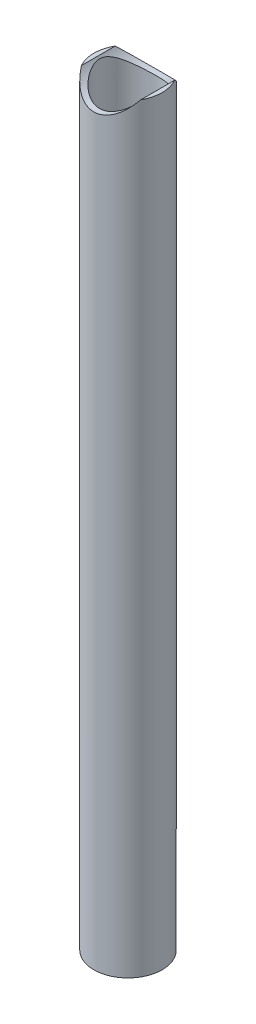
ISO-10303-21;
HEADER;
FILE_DESCRIPTION(('STEP AP214'),'2;1');
FILE_NAME('part.step','',(''),(''),'','','');
FILE_SCHEMA(('AUTOMOTIVE_DESIGN { 1 0 10303 214 1 1 1 1 }'));
ENDSEC;
DATA;
#1=APPLICATION_CONTEXT('core data for automotive mechanical design processes');
#2=APPLICATION_PROTOCOL_DEFINITION('international standard','automotive_design',2000,#1);
#3=PRODUCT_CONTEXT('',#1,'mechanical');
#4=PRODUCT('Part','Part','',(#3));
#5=PRODUCT_RELATED_PRODUCT_CATEGORY('part','',(#4));
#6=PRODUCT_DEFINITION_FORMATION('','',#4);
#7=PRODUCT_DEFINITION_CONTEXT('part definition',#1,'design');
#8=PRODUCT_DEFINITION('design','',#6,#7);
#9=PRODUCT_DEFINITION_SHAPE('','',#8);
#10=(LENGTH_UNIT() NAMED_UNIT(*) SI_UNIT(.MILLI.,.METRE.));
#11=(NAMED_UNIT(*) PLANE_ANGLE_UNIT() SI_UNIT($,.RADIAN.));
#12=(NAMED_UNIT(*) SI_UNIT($,.STERADIAN.) SOLID_ANGLE_UNIT());
#13=UNCERTAINTY_MEASURE_WITH_UNIT(LENGTH_MEASURE(1.E-05),#10,'distance_accuracy_value','');
#14=(GEOMETRIC_REPRESENTATION_CONTEXT(3) GLOBAL_UNCERTAINTY_ASSIGNED_CONTEXT((#13)) GLOBAL_UNIT_ASSIGNED_CONTEXT((#10,
#11,#12)) REPRESENTATION_CONTEXT('',''));
#15=CARTESIAN_POINT('',(0.,0.,0.));
#16=DIRECTION('',(0.,0.,1.));
#17=DIRECTION('',(1.,0.,0.));
#18=AXIS2_PLACEMENT_3D('',#15,#16,#17);
#19=CARTESIAN_POINT('',(0.,0.,0.));
#20=DIRECTION('',(0.,1.,0.));
#21=DIRECTION('',(0.,0.,1.));
#22=AXIS2_PLACEMENT_3D('',#19,#20,#21);
#23=CYLINDRICAL_SURFACE('',#22,17.526);
#24=CARTESIAN_POINT('',(17.5260000000057,467.884334709337,0.));
#25=CARTESIAN_POINT('',(17.5259966167378,467.88432617058,-0.319076188077624));
#26=CARTESIAN_POINT('',(17.51726257199,467.871890608762,-0.638240508763436));
#27=CARTESIAN_POINT('',(17.4825449115086,467.822784525985,-1.27387357273026));
#28=CARTESIAN_POINT('',(17.4565505154207,467.786098859123,-1.59034050610202));
#29=CARTESIAN_POINT('',(17.3878622453003,467.690215161303,-2.21880690947676));
#30=CARTESIAN_POINT('',(17.3451257780519,467.63095972172,-2.53079286403182));
#31=CARTESIAN_POINT('',(17.2438450795274,467.492571776205,-3.14774559895822));
#32=CARTESIAN_POINT('',(17.1852949843206,467.413431897585,-3.45270972991493));
#33=CARTESIAN_POINT('',(17.0290281907694,467.205942571117,-4.16540577796842));
#34=CARTESIAN_POINT('',(16.924830124194,467.070207980364,-4.56956911668166));
#35=CARTESIAN_POINT('',(16.6909426156402,466.774553737813,-5.36131842118699));
#36=CARTESIAN_POINT('',(16.5612408889475,466.614622439433,-5.7488962880344));
#37=CARTESIAN_POINT('',(16.2778377765882,466.27675589372,-6.50824927608016));
#38=CARTESIAN_POINT('',(16.1240772300419,466.098776656443,-6.8799824890451));
#39=CARTESIAN_POINT('',(15.7941184848056,465.730635525697,-7.60695943519018));
#40=CARTESIAN_POINT('',(15.6179210686258,465.540474057212,-7.96220374284949));
#41=CARTESIAN_POINT('',(15.1684387105771,465.074120916929,-8.79691850022176));
#42=CARTESIAN_POINT('',(14.8846663476882,464.794177119885,-9.26867500052876));
#43=CARTESIAN_POINT('',(14.2757977852007,464.228975234517,-10.1815187143384));
#44=CARTESIAN_POINT('',(13.9506852846529,463.943715087962,-10.6225937230168));
#45=CARTESIAN_POINT('',(13.2599882765244,463.376219321179,-11.4731513123116));
#46=CARTESIAN_POINT('',(12.8944394913868,463.093981269169,-11.8826612440536));
#47=CARTESIAN_POINT('',(12.1229083848525,462.539406738952,-12.6688154804112));
#48=CARTESIAN_POINT('',(11.7169405718745,462.267066755405,-13.0454714875213));
#49=CARTESIAN_POINT('',(10.9523102536056,461.793111751858,-13.6895404997737));
#50=CARTESIAN_POINT('',(10.6010399418016,461.588453168338,-13.9635083458199));
#51=CARTESIAN_POINT('',(9.87345155992662,461.19285074123,-14.4871138222371));
#52=CARTESIAN_POINT('',(9.49713454197172,461.001906322262,-14.7367524735));
#53=CARTESIAN_POINT('',(8.72070202883775,460.637341948865,-15.2090842162129));
#54=CARTESIAN_POINT('',(8.32061782316001,460.463699988611,-15.4318116129725));
#55=CARTESIAN_POINT('',(7.49751933777661,460.136876899184,-15.8480419800032));
#56=CARTESIAN_POINT('',(7.07450906657809,459.983692209281,-16.0415500368711));
#57=CARTESIAN_POINT('',(6.28025424486751,459.724825268381,-16.3667690599142));
#58=CARTESIAN_POINT('',(5.91221216564464,459.615484365574,-16.503401754469));
#59=CARTESIAN_POINT('',(5.16329368160522,459.415167450773,-16.7528138187347));
#60=CARTESIAN_POINT('',(4.7824196520745,459.324188061491,-16.8655975752347));
#61=CARTESIAN_POINT('',(4.00999437526974,459.162300485671,-17.0657472209478));
#62=CARTESIAN_POINT('',(3.61844688444468,459.091385335152,-17.1531219295349));
#63=CARTESIAN_POINT('',(2.82705689110886,458.971011274658,-17.3011693137797));
#64=CARTESIAN_POINT('',(2.42721429150704,458.921552615972,-17.3618416767118));
#65=CARTESIAN_POINT('',(1.62057958091167,458.845005592612,-17.4556549470083));
#66=CARTESIAN_POINT('',(1.2137664729376,458.818005078865,-17.4886877379134));
#67=CARTESIAN_POINT('',(0.397941374213328,458.787307210659,-17.5262391050122));
#68=CARTESIAN_POINT('',(-0.0110706209749511,458.783609903252,-17.530757623633));
#69=CARTESIAN_POINT('',(-0.827943717159224,458.799602549319,-17.5111994984361));
#70=CARTESIAN_POINT('',(-1.23580482424931,458.819292378721,-17.4871230063182));
#71=CARTESIAN_POINT('',(-2.04709283680859,458.881613358313,-17.4108036791932));
#72=CARTESIAN_POINT('',(-2.45051986964381,458.924243847782,-17.3585616553922));
#73=CARTESIAN_POINT('',(-3.22539887652972,459.028218129667,-17.2308479950609));
#74=CARTESIAN_POINT('',(-3.59729605361219,459.088256092851,-17.1569948006647));
#75=CARTESIAN_POINT('',(-4.33226890799549,459.226614528515,-16.9863018111114));
#76=CARTESIAN_POINT('',(-4.69534502405514,459.304934089606,-16.8894631618398));
#77=CARTESIAN_POINT('',(-5.41085673321429,459.478531384207,-16.6740198227789));
#78=CARTESIAN_POINT('',(-5.76329076440113,459.573811592977,-16.5554119558831));
#79=CARTESIAN_POINT('',(-6.45595687093966,459.779824257219,-16.2977871460212));
#80=CARTESIAN_POINT('',(-6.79618822322116,459.890557626474,-16.1587689961211));
#81=CARTESIAN_POINT('',(-7.49362304526296,460.136594261049,-15.8481849599276));
#82=CARTESIAN_POINT('',(-7.84955408561314,460.27321634847,-15.6748085298315));
#83=CARTESIAN_POINT('',(-8.54437048022812,460.560835019082,-15.3071530177086));
#84=CARTESIAN_POINT('',(-8.88325498620354,460.71183231655,-15.1128728969553));
#85=CARTESIAN_POINT('',(-9.54331346645607,461.026113663825,-14.7049787879664));
#86=CARTESIAN_POINT('',(-9.86448321905139,461.189400620701,-14.491360222863));
#87=CARTESIAN_POINT('',(-10.4886015638354,461.5261449485,-14.0462403039745));
#88=CARTESIAN_POINT('',(-10.7915476234653,461.699603726425,-13.8147364748272));
#89=CARTESIAN_POINT('',(-11.439848439002,462.091423252358,-13.2853358563753));
#90=CARTESIAN_POINT('',(-11.7809741839097,462.311637517782,-12.9836249082526));
#91=CARTESIAN_POINT('',(-12.4360687716025,462.760219030517,-12.3575971323187));
#92=CARTESIAN_POINT('',(-12.7500333861304,462.988587539436,-12.033276798975));
#93=CARTESIAN_POINT('',(-13.3510865510101,463.450008883021,-11.3627536857685));
#94=CARTESIAN_POINT('',(-13.6381378650007,463.683067681245,-11.0165216667337));
#95=CARTESIAN_POINT('',(-14.1847154460037,464.149482695955,-10.3032235858581));
#96=CARTESIAN_POINT('',(-14.4442441845379,464.382838883827,-9.93615939929388));
#97=CARTESIAN_POINT('',(-14.9253779852041,464.835766313745,-9.19675303324431));
#98=CARTESIAN_POINT('',(-15.1481021343213,465.055510310931,-8.82524531613509));
#99=CARTESIAN_POINT('',(-15.5673632453814,465.486269379661,-8.06270572980613));
#100=CARTESIAN_POINT('',(-15.763895326286,465.697282819178,-7.67167024009006));
#101=CARTESIAN_POINT('',(-16.1293414191598,466.104306922036,-6.87013687577863));
#102=CARTESIAN_POINT('',(-16.2982946475782,466.300338674101,-6.45966772673671));
#103=CARTESIAN_POINT('',(-16.6070872445574,466.670276739207,-5.61835143092385));
#104=CARTESIAN_POINT('',(-16.7469436463786,466.844195973576,-5.18751638865614));
#105=CARTESIAN_POINT('',(-16.9536602371012,467.108069924402,-4.45278112831981));
#106=CARTESIAN_POINT('',(-17.0293113935189,467.206686079221,-4.15445176275752));
#107=CARTESIAN_POINT('',(-17.1656161190957,467.387036358885,-3.54941976092459));
#108=CARTESIAN_POINT('',(-17.2262752409978,467.468776732321,-3.24272027165383));
#109=CARTESIAN_POINT('',(-17.3314566546328,467.612125065521,-2.62293154598005));
#110=CARTESIAN_POINT('',(-17.3760290436154,467.673795467109,-2.30986541087077));
#111=CARTESIAN_POINT('',(-17.4483464333207,467.774571318271,-1.67831422631321));
#112=CARTESIAN_POINT('',(-17.4761027039468,467.813691879544,-1.35983295349184));
#113=CARTESIAN_POINT('',(-17.5053896579413,467.855090068554,-0.867175401837867));
#114=CARTESIAN_POINT('',(-17.5131110395884,467.866037726154,-0.694043200107051));
#115=CARTESIAN_POINT('',(-17.5234176731224,467.880663137073,-0.347282765117778));
#116=CARTESIAN_POINT('',(-17.5260018413152,467.884339356482,-0.173654434935381));
#117=CARTESIAN_POINT('',(-17.5259966167301,467.884326170582,0.319076188077935));
#118=CARTESIAN_POINT('',(-17.5172625719879,467.871890608763,0.638240508763874));
#119=CARTESIAN_POINT('',(-17.4825449115106,467.822784525985,1.27387357273079));
#120=CARTESIAN_POINT('',(-17.4565505154212,467.786098859123,1.59034050610253));
#121=CARTESIAN_POINT('',(-17.3878622452997,467.690215161303,2.21880690947716));
#122=CARTESIAN_POINT('',(-17.3451257780517,467.63095972172,2.53079286403216));
#123=CARTESIAN_POINT('',(-17.2438450795275,467.492571776205,3.1477455989584));
#124=CARTESIAN_POINT('',(-17.1852949843206,467.413431897585,3.45270972991502));
#125=CARTESIAN_POINT('',(-17.0290281907693,467.205942571117,4.1654057779684));
#126=CARTESIAN_POINT('',(-16.924830124194,467.070207980364,4.56956911668161));
#127=CARTESIAN_POINT('',(-16.6909426156402,466.774553737813,5.36131842118683));
#128=CARTESIAN_POINT('',(-16.5612408889476,466.614622439433,5.74889628803413));
#129=CARTESIAN_POINT('',(-16.2778377765883,466.27675589372,6.50824927607986));
#130=CARTESIAN_POINT('',(-16.124077230042,466.098776656443,6.87998248904487));
#131=CARTESIAN_POINT('',(-15.7941184848056,465.730635525697,7.60695943519006));
#132=CARTESIAN_POINT('',(-15.6179210686258,465.540474057212,7.96220374284943));
#133=CARTESIAN_POINT('',(-15.168438710577,465.074120916929,8.79691850022182));
#134=CARTESIAN_POINT('',(-14.8846663476881,464.794177119885,9.26867500052888));
#135=CARTESIAN_POINT('',(-14.2757977852006,464.228975234517,10.1815187143386));
#136=CARTESIAN_POINT('',(-13.9506852846527,463.943715087962,10.622593723017));
#137=CARTESIAN_POINT('',(-13.2599882765243,463.376219321178,11.4731513123118));
#138=CARTESIAN_POINT('',(-12.8944394913867,463.093981269169,11.8826612440537));
#139=CARTESIAN_POINT('',(-12.1229083848524,462.539406738952,12.6688154804112));
#140=CARTESIAN_POINT('',(-11.7169405718744,462.267066755405,13.0454714875213));
#141=CARTESIAN_POINT('',(-10.9523102536056,461.793111751858,13.6895404997737));
#142=CARTESIAN_POINT('',(-10.6010399418017,461.588453168338,13.9635083458199));
#143=CARTESIAN_POINT('',(-9.87345155992667,461.19285074123,14.4871138222371));
#144=CARTESIAN_POINT('',(-9.49713454197178,461.001906322262,14.7367524735));
#145=CARTESIAN_POINT('',(-8.72070202883782,460.637341948865,15.2090842162129));
#146=CARTESIAN_POINT('',(-8.32061782316007,460.463699988611,15.4318116129724));
#147=CARTESIAN_POINT('',(-7.49751933777664,460.136876899184,15.8480419800032));
#148=CARTESIAN_POINT('',(-7.07450906657811,459.983692209281,16.0415500368711));
#149=CARTESIAN_POINT('',(-6.28025424486751,459.724825268381,16.3667690599142));
#150=CARTESIAN_POINT('',(-5.91221216564464,459.615484365574,16.503401754469));
#151=CARTESIAN_POINT('',(-5.1632936816052,459.415167450773,16.7528138187347));
#152=CARTESIAN_POINT('',(-4.78241965207447,459.324188061491,16.8655975752347));
#153=CARTESIAN_POINT('',(-4.00999437526971,459.162300485671,17.0657472209478));
#154=CARTESIAN_POINT('',(-3.61844688444465,459.091385335152,17.153121929535));
#155=CARTESIAN_POINT('',(-2.82705689110885,458.971011274658,17.3011693137798));
#156=CARTESIAN_POINT('',(-2.42721429150704,458.921552615972,17.3618416767118));
#157=CARTESIAN_POINT('',(-1.62057958091167,458.845005592612,17.4556549470083));
#158=CARTESIAN_POINT('',(-1.2137664729376,458.818005078865,17.4886877379134));
#159=CARTESIAN_POINT('',(-0.397941374213323,458.787307210659,17.5262391050122));
#160=CARTESIAN_POINT('',(0.0110706209749554,458.783609903252,17.530757623633));
#161=CARTESIAN_POINT('',(0.827943717159227,458.799602549319,17.5111994984361));
#162=CARTESIAN_POINT('',(1.23580482424931,458.819292378721,17.4871230063182));
#163=CARTESIAN_POINT('',(2.0470928368086,458.881613358313,17.4108036791932));
#164=CARTESIAN_POINT('',(2.45051986964381,458.924243847782,17.3585616553922));
#165=CARTESIAN_POINT('',(3.22539887652971,459.028218129667,17.2308479950609));
#166=CARTESIAN_POINT('',(3.59729605361216,459.088256092851,17.1569948006648));
#167=CARTESIAN_POINT('',(4.33226890799546,459.226614528515,16.9863018111114));
#168=CARTESIAN_POINT('',(4.69534502405511,459.304934089606,16.8894631618398));
#169=CARTESIAN_POINT('',(5.41085673321427,459.478531384207,16.6740198227789));
#170=CARTESIAN_POINT('',(5.76329076440111,459.573811592977,16.5554119558831));
#171=CARTESIAN_POINT('',(6.45595687093965,459.779824257219,16.2977871460212));
#172=CARTESIAN_POINT('',(6.79618822322116,459.890557626474,16.1587689961211));
#173=CARTESIAN_POINT('',(7.49362304526297,460.136594261049,15.8481849599276));
#174=CARTESIAN_POINT('',(7.84955408561315,460.27321634847,15.6748085298315));
#175=CARTESIAN_POINT('',(8.54437048022813,460.560835019082,15.3071530177086));
#176=CARTESIAN_POINT('',(8.88325498620355,460.71183231655,15.1128728969553));
#177=CARTESIAN_POINT('',(9.54331346645609,461.026113663825,14.7049787879664));
#178=CARTESIAN_POINT('',(9.86448321905142,461.189400620701,14.491360222863));
#179=CARTESIAN_POINT('',(10.4886015638354,461.526144948501,14.0462403039745));
#180=CARTESIAN_POINT('',(10.7915476234653,461.699603726425,13.8147364748272));
#181=CARTESIAN_POINT('',(11.4398484390019,462.091423252358,13.2853358563754));
#182=CARTESIAN_POINT('',(11.7809741839097,462.311637517782,12.9836249082527));
#183=CARTESIAN_POINT('',(12.4360687716024,462.760219030517,12.3575971323188));
#184=CARTESIAN_POINT('',(12.7500333861304,462.988587539436,12.0332767989751));
#185=CARTESIAN_POINT('',(13.3510865510101,463.450008883021,11.3627536857686));
#186=CARTESIAN_POINT('',(13.6381378650006,463.683067681245,11.0165216667338));
#187=CARTESIAN_POINT('',(14.1847154460037,464.149482695955,10.3032235858581));
#188=CARTESIAN_POINT('',(14.4442441845379,464.382838883827,9.93615939929389));
#189=CARTESIAN_POINT('',(14.9253779852041,464.835766313745,9.19675303324428));
#190=CARTESIAN_POINT('',(15.1481021343214,465.055510310931,8.82524531613502));
#191=CARTESIAN_POINT('',(15.5673632453815,465.486269379661,8.06270572980595));
#192=CARTESIAN_POINT('',(15.7638953262862,465.697282819178,7.67167024008982));
#193=CARTESIAN_POINT('',(16.1293414191599,466.104306922036,6.87013687577837));
#194=CARTESIAN_POINT('',(16.2982946475783,466.300338674101,6.45966772673649));
#195=CARTESIAN_POINT('',(16.6070872445575,466.670276739207,5.61835143092374));
#196=CARTESIAN_POINT('',(16.7469436463786,466.844195973576,5.18751638865608));
#197=CARTESIAN_POINT('',(16.9536602371012,467.108069924402,4.45278112831985));
#198=CARTESIAN_POINT('',(17.0293113935189,467.206686079221,4.15445176275761));
#199=CARTESIAN_POINT('',(17.1656161190957,467.387036358884,3.54941976092476));
#200=CARTESIAN_POINT('',(17.2262752409979,467.468776732321,3.24272027165403));
#201=CARTESIAN_POINT('',(17.3314566546327,467.61212506552,2.62293154598024));
#202=CARTESIAN_POINT('',(17.3760290436152,467.673795467109,2.30986541087091));
#203=CARTESIAN_POINT('',(17.4483464333209,467.774571318271,1.67831422631326));
#204=CARTESIAN_POINT('',(17.4761027039476,467.813691879544,1.35983295349187));
#205=CARTESIAN_POINT('',(17.5053896579408,467.855090068554,0.867175401837875));
#206=CARTESIAN_POINT('',(17.5131110395871,467.866037726155,0.694043200107066));
#207=CARTESIAN_POINT('',(17.5234176731237,467.880663137073,0.347282765117854));
#208=CARTESIAN_POINT('',(17.5260018413198,467.884339356481,0.173654434935511));
#209=CARTESIAN_POINT('',(17.5260000000057,467.884334709337,0.));
#210=B_SPLINE_CURVE_WITH_KNOTS('',3,(#24,#25,#26,#27,#28,#29,#30,#31,#32,#33,#34,#35,#36,#37,
#38,#39,#40,#41,#42,#43,#44,#45,#46,#47,#48,#49,#50,#51,#52,#53,#54,#55,#56,#57,#58,#59,#60,#61,
#62,#63,#64,#65,#66,#67,#68,#69,#70,#71,#72,#73,#74,#75,#76,#77,#78,#79,#80,#81,#82,#83,#84,#85,
#86,#87,#88,#89,#90,#91,#92,#93,#94,#95,#96,#97,#98,#99,#100,#101,#102,#103,#104,#105,#106,#107,
#108,#109,#110,#111,#112,#113,#114,#115,#116,#117,#118,#119,#120,#121,#122,#123,#124,#125,#126,
#127,#128,#129,#130,#131,#132,#133,#134,#135,#136,#137,#138,#139,#140,#141,#142,#143,#144,#145,
#146,#147,#148,#149,#150,#151,#152,#153,#154,#155,#156,#157,#158,#159,#160,#161,#162,#163,#164,
#165,#166,#167,#168,#169,#170,#171,#172,#173,#174,#175,#176,#177,#178,#179,#180,#181,#182,#183,
#184,#185,#186,#187,#188,#189,#190,#191,#192,#193,#194,#195,#196,#197,#198,#199,#200,#201,#202,
#203,#204,#205,#206,#207,#208,#209),.UNSPECIFIED.,.T.,.F.,(4,2,2,2,2,2,2,2,2,2,2,2,2,2,2,2,2,2,
2,2,2,2,2,2,2,2,2,2,2,2,2,2,2,2,2,2,2,2,2,2,2,2,2,2,2,2,2,2,2,2,2,2,2,2,2,2,2,2,2,2,2,2,2,2,2,2,
2,2,2,2,2,2,2,2,2,2,2,2,2,2,2,2,2,2,2,2,2,2,2,2,2,2,4),(0.,0.957028803679463,1.9146559049294,
2.87473527777311,3.83517115241394,5.14973807242214,6.46493975677991,7.78342788903949,
9.10187005018092,10.9523123288732,12.8034865367084,14.6530382372429,16.5019284180806,
17.9713466941596,19.4407032845167,20.9081665857837,22.3753741310654,23.5967404641885,
24.8178819425912,26.0385990606161,27.2593304747379,28.4848149366935,29.710301873008,
30.9357823079984,32.1612274493443,33.311629001132,34.4619732144101,35.6124854482696,
36.7630657435203,38.0183344145918,39.2736654901255,40.5292944479692,41.7850975001873,
43.3012548619961,44.8176478255635,46.3361087816726,47.8544332646222,49.3104622613961,
50.7667622190167,52.2209729662504,53.6743300092622,54.6431268243694,55.6115642773947,
56.576959258516,57.5417065290147,58.0624512765263,58.5833058633924,59.5403346670722,
60.497961768322,61.4580411411656,62.4184770158061,63.7330439358142,65.0482456201717,
66.3667337524314,67.6851759135731,69.5356181922656,71.386792400101,73.2363441006352,
75.0852342814728,76.5546525575518,78.0240091479088,79.4914724491758,80.9586799944576,
82.1800463275807,83.4011878059835,84.6219049240083,85.8426363381301,87.0681208000857,
88.2936077364002,89.5190881713906,90.7445333127364,91.8949348645241,93.0452790778023,
94.1957913116618,95.3463716069124,96.601640277984,97.8569713535177,99.1126003113614,
100.368403363579,101.884560725388,103.400953688955,104.919414645065,106.437739128014,
107.893768124788,109.350068082409,110.804278829643,112.257635872654,113.226432687761,
114.194870140787,115.160265121908,116.125012392407,116.645757139918,117.166611726784),.UNSPECIFIED.);
#211=CARTESIAN_POINT('',(17.5260000000057,467.884334709337,0.));
#212=VERTEX_POINT('',#211);
#213=EDGE_CURVE('E21',#212,#212,#210,.T.);
#214=ORIENTED_EDGE('',*,*,#213,.T.);
#215=EDGE_LOOP('',(#214));
#216=FACE_BOUND('',#215,.T.);
#217=CARTESIAN_POINT('',(-14.7320000000002,0.,-9.49362164824335));
#218=CARTESIAN_POINT('',(-14.8512768378807,1.18567366094348E-05,-9.30853858785234));
#219=CARTESIAN_POINT('',(-14.9670401513545,0.00336025535581087,-9.12123138228475));
#220=CARTESIAN_POINT('',(-15.1913280769663,0.0156361272029989,-8.74257363879652));
#221=CARTESIAN_POINT('',(-15.2998546298961,0.0245620978949944,-8.55122420321666));
#222=CARTESIAN_POINT('',(-15.5094219734196,0.0468896508454727,-8.16497091437258));
#223=CARTESIAN_POINT('',(-15.6104697947254,0.0602869626121937,-7.97007061974777));
#224=CARTESIAN_POINT('',(-15.8050766923314,0.0905510610284354,-7.57683077316113));
#225=CARTESIAN_POINT('',(-15.8986352341418,0.107418094996536,-7.37849097695814));
#226=CARTESIAN_POINT('',(-16.1683109406556,0.161847115220246,-6.77785226085186));
#227=CARTESIAN_POINT('',(-16.3330093959,0.203184711084875,-6.37070633388372));
#228=CARTESIAN_POINT('',(-16.6313329505743,0.288719471062349,-5.54545234654736));
#229=CARTESIAN_POINT('',(-16.7649519139684,0.33291719765398,-5.1273421395977));
#230=CARTESIAN_POINT('',(-16.989149442954,0.413623974218271,-4.32279802081029));
#231=CARTESIAN_POINT('',(-17.0826397029462,0.450463273768551,-3.93720826814375));
#232=CARTESIAN_POINT('',(-17.2433279085767,0.517048885333327,-3.16002017297867));
#233=CARTESIAN_POINT('',(-17.3105301942946,0.546796367872237,-2.76842283342149));
#234=CARTESIAN_POINT('',(-17.4181006554558,0.595796397634473,-1.98183023019654));
#235=CARTESIAN_POINT('',(-17.4585311972106,0.615073317654542,-1.58684505055578));
#236=CARTESIAN_POINT('',(-17.5124805157628,0.641027782057902,-0.794550289194888));
#237=CARTESIAN_POINT('',(-17.5259976422763,0.647704553820625,-0.39724056643585));
#238=CARTESIAN_POINT('',(-17.5260013446963,0.647719611364174,0.226560860476848));
#239=CARTESIAN_POINT('',(-17.5216065525146,0.64555635278682,0.453099225514268));
#240=CARTESIAN_POINT('',(-17.5040436962304,0.636998814319318,0.905771133232719));
#241=CARTESIAN_POINT('',(-17.4908754188329,0.630604431564945,1.13190466593772));
#242=CARTESIAN_POINT('',(-17.4557990255929,0.613816973869189,1.58335761895379));
#243=CARTESIAN_POINT('',(-17.4338903157912,0.603423627178539,1.80867698288753));
#244=CARTESIAN_POINT('',(-17.3813925618602,0.579034466592906,2.25811317057391));
#245=CARTESIAN_POINT('',(-17.3508027010911,0.565038313791909,2.48222987917032));
#246=CARTESIAN_POINT('',(-17.2459295569409,0.518308316325325,3.15340303711726));
#247=CARTESIAN_POINT('',(-17.1586295918297,0.480878860619408,3.59816727949413));
#248=CARTESIAN_POINT('',(-16.9500707191891,0.398936749124965,4.47891555375538));
#249=CARTESIAN_POINT('',(-16.8288114805177,0.354424024268253,4.91489949997736));
#250=CARTESIAN_POINT('',(-16.5740184826926,0.271797924889355,5.71046688209059));
#251=CARTESIAN_POINT('',(-16.4451743864335,0.233743522671846,6.07156461238672));
#252=CARTESIAN_POINT('',(-16.1639804343157,0.161866969447925,6.78478502075457));
#253=CARTESIAN_POINT('',(-16.0116391141145,0.128043289627202,7.1369109040527));
#254=CARTESIAN_POINT('',(-15.6843812976354,0.0696335181760638,7.82988555736756));
#255=CARTESIAN_POINT('',(-15.5095453317572,0.0450156421794435,8.17076935360042));
#256=CARTESIAN_POINT('',(-15.2304938677732,0.0189072501565633,8.67349628714565));
#257=CARTESIAN_POINT('',(-15.1346193031661,0.0120067029515504,8.83972858230823));
#258=CARTESIAN_POINT('',(-14.9373887586073,0.00255573299417623,9.16907579603087));
#259=CARTESIAN_POINT('',(-14.8360317138495,6.15843913342474E-06,9.3321901006296));
#260=CARTESIAN_POINT('',(-14.7320000000002,0.,9.49362164824335));
#261=B_SPLINE_CURVE_WITH_KNOTS('',3,(#217,#218,#219,#220,#221,#222,#223,#224,#225,#226,#227,
#228,#229,#230,#231,#232,#233,#234,#235,#236,#237,#238,#239,#240,#241,#242,#243,#244,#245,#246,
#247,#248,#249,#250,#251,#252,#253,#254,#255,#256,#257,#258,#259,#260),.UNSPECIFIED.,.F.,.F.,(4,
2,2,2,2,2,2,2,2,2,2,2,2,2,2,2,2,2,2,2,2,4),(0.,0.660450268660075,1.32072269600756,
1.9803663059287,2.6400569509366,3.9620711134059,5.28434606050904,6.47882279439166,
7.67310223981106,8.86458966228416,10.0561501424516,10.7357407746952,11.4153479292929,
12.0950012746982,12.7747185765936,14.1375014803103,15.5002976731889,16.6553293330489,
17.8099423972659,18.9605313569332,19.5364648376884,20.1125105805729),.UNSPECIFIED.);
#262=CARTESIAN_POINT('',(-14.7320000000001,0.,-9.49362164824348));
#263=VERTEX_POINT('',#262);
#264=CARTESIAN_POINT('',(-14.7320000000001,0.,9.49362164824348));
#265=VERTEX_POINT('',#264);
#266=EDGE_CURVE('E112',#263,#265,#261,.T.);
#267=ORIENTED_EDGE('',*,*,#266,.F.);
#268=CARTESIAN_POINT('',(0.,0.,0.));
#269=DIRECTION('',(0.,1.,0.));
#270=DIRECTION('',(0.,0.,1.));
#271=AXIS2_PLACEMENT_3D('',#268,#269,#270);
#272=CIRCLE('',#271,17.526);
#273=EDGE_CURVE('E83',#263,#265,#272,.F.);
#274=ORIENTED_EDGE('',*,*,#273,.T.);
#275=EDGE_LOOP('',(#267,#274));
#276=FACE_BOUND('',#275,.T.);
#277=ADVANCED_FACE('F17',(#216,#276),#23,.F.);
#278=CARTESIAN_POINT('',(0.,469.10625,0.));
#279=DIRECTION('',(0.,1.,0.));
#280=DIRECTION('',(0.,0.,1.));
#281=AXIS2_PLACEMENT_3D('',#278,#279,#280);
#282=PLANE('',#281);
#283=CARTESIAN_POINT('',(0.,469.10625,0.));
#284=DIRECTION('',(0.,1.,0.));
#285=DIRECTION('',(0.,0.,1.));
#286=AXIS2_PLACEMENT_3D('',#283,#284,#285);
#287=CIRCLE('',#286,21.082);
#288=CARTESIAN_POINT('',(-18.3251417542268,469.10625,10.4230467564668));
#289=VERTEX_POINT('',#288);
#290=CARTESIAN_POINT('',(-18.3251417542266,469.10625,-10.4230467564672));
#291=VERTEX_POINT('',#290);
#292=EDGE_CURVE('E60',#289,#291,#287,.F.);
#293=ORIENTED_EDGE('',*,*,#292,.F.);
#294=DIRECTION('',(0.,0.,1.));
#295=VECTOR('',#294,1.);
#296=CARTESIAN_POINT('',(-18.325141754227,469.106250000001,-59.1058));
#297=LINE('',#296,#295);
#298=EDGE_CURVE('E82',#289,#291,#297,.F.);
#299=ORIENTED_EDGE('',*,*,#298,.T.);
#300=EDGE_LOOP('',(#293,#299));
#301=FACE_BOUND('',#300,.T.);
#302=ADVANCED_FACE('F142',(#301),#282,.T.);
#303=CARTESIAN_POINT('',(0.,480.21875,-59.1058));
#304=DIRECTION('',(0.,0.,1.));
#305=DIRECTION('',(1.,0.,0.));
#306=AXIS2_PLACEMENT_3D('',#303,#304,#305);
#307=CYLINDRICAL_SURFACE('',#306,21.43125);
#308=ORIENTED_EDGE('',*,*,#213,.F.);
#309=EDGE_LOOP('',(#308));
#310=FACE_BOUND('',#309,.T.);
#311=DIRECTION('',(0.,0.,1.));
#312=VECTOR('',#311,1.);
#313=CARTESIAN_POINT('',(18.3251417542254,469.10625,0.));
#314=LINE('',#313,#312);
#315=CARTESIAN_POINT('',(18.325141754226,469.10625,-10.4230467564682));
#316=VERTEX_POINT('',#315);
#317=CARTESIAN_POINT('',(18.3251417542258,469.10625,10.4230467564686));
#318=VERTEX_POINT('',#317);
#319=EDGE_CURVE('E77',#316,#318,#314,.T.);
#320=ORIENTED_EDGE('',*,*,#319,.F.);
#321=CARTESIAN_POINT('',(-18.3251417542262,469.106249999999,-10.4230467564679));
#322=CARTESIAN_POINT('',(-18.1546669610887,468.825127971071,-10.7227290527011));
#323=CARTESIAN_POINT('',(-17.9762521103228,468.545502562748,-11.0193331862278));
#324=CARTESIAN_POINT('',(-17.603174683745,467.990150326794,-11.6060349899294));
#325=CARTESIAN_POINT('',(-17.4085087028067,467.714424330437,-11.8961312802681));
#326=CARTESIAN_POINT('',(-17.0019836765292,467.167021169007,-12.4702576819994));
#327=CARTESIAN_POINT('',(-16.7900716325992,466.895359774209,-12.7542654238679));
#328=CARTESIAN_POINT('',(-16.3492935730373,466.358020228613,-13.3145928128943));
#329=CARTESIAN_POINT('',(-16.1204285684027,466.092341722253,-13.5909129171583));
#330=CARTESIAN_POINT('',(-15.4019360975931,465.299230269302,-14.4140977013324));
#331=CARTESIAN_POINT('',(-14.8853547110108,464.782459591846,-14.9481374038877));
#332=CARTESIAN_POINT('',(-13.7792427951948,463.787584313184,-15.9734367489108));
#333=CARTESIAN_POINT('',(-13.189821109303,463.309423744234,-16.4647583961952));
#334=CARTESIAN_POINT('',(-12.1914293172031,462.587014082934,-17.2056406985864));
#335=CARTESIAN_POINT('',(-11.8065697558803,462.326726905096,-17.4722548638437));
#336=CARTESIAN_POINT('',(-11.0105895807883,461.826187579026,-17.984481249431));
#337=CARTESIAN_POINT('',(-10.5994692284442,461.585935231403,-18.2300936787757));
#338=CARTESIAN_POINT('',(-9.75332190905766,461.129451847357,-18.6964116129859));
#339=CARTESIAN_POINT('',(-9.31840297433261,460.91312386012,-18.9172177051281));
#340=CARTESIAN_POINT('',(-8.42422790375238,460.506521818928,-19.3319907253941));
#341=CARTESIAN_POINT('',(-7.9649754708652,460.316243816501,-19.5259617210382));
#342=CARTESIAN_POINT('',(-7.09342871479429,459.990920590372,-19.8574465979527));
#343=CARTESIAN_POINT('',(-6.68419026822036,459.851868174079,-19.9990679012435));
#344=CARTESIAN_POINT('',(-5.8511268704562,459.597100131136,-20.2584620806643));
#345=CARTESIAN_POINT('',(-5.42730320377621,459.481382455538,-20.3762370506676));
#346=CARTESIAN_POINT('',(-4.56718208473583,459.275136629058,-20.586101259301));
#347=CARTESIAN_POINT('',(-4.13088142691732,459.184615016574,-20.6781838307488));
#348=CARTESIAN_POINT('',(-3.24868439523585,459.030427516734,-20.8350056910957));
#349=CARTESIAN_POINT('',(-2.8027879510906,458.96676182615,-20.8997447796517));
#350=CARTESIAN_POINT('',(-1.90287739277508,458.867327242993,-21.0008472531159));
#351=CARTESIAN_POINT('',(-1.44883815025849,458.831669663795,-21.0370974140346));
#352=CARTESIAN_POINT('',(-0.538006059784569,458.789404091888,-21.0800647183436));
#353=CARTESIAN_POINT('',(-0.081213206735805,458.782796152909,-21.0867818071104));
#354=CARTESIAN_POINT('',(0.831309948877434,458.798767722317,-21.070545561698));
#355=CARTESIAN_POINT('',(1.28704029102061,458.821346125526,-21.0475933509843));
#356=CARTESIAN_POINT('',(2.19371817036819,458.895219582443,-20.9724877595272));
#357=CARTESIAN_POINT('',(2.64466584274158,458.946513822362,-20.9203352063041));
#358=CARTESIAN_POINT('',(3.50770609591001,459.072320812162,-20.7923986040815));
#359=CARTESIAN_POINT('',(3.92034567137933,459.145004231551,-20.7184761705479));
#360=CARTESIAN_POINT('',(4.73598238868334,459.313192644567,-20.5473799397617));
#361=CARTESIAN_POINT('',(5.13898027223503,459.408695876458,-20.4502079374216));
#362=CARTESIAN_POINT('',(5.93310060888487,459.621039980175,-20.2340878173185));
#363=CARTESIAN_POINT('',(6.32422847038821,459.737870958774,-20.1151497960193));
#364=CARTESIAN_POINT('',(7.09319682724352,459.991317793235,-19.8570354633955));
#365=CARTESIAN_POINT('',(7.47103470832531,460.127937514986,-19.7178551975656));
#366=CARTESIAN_POINT('',(8.340921313972,460.469946081268,-19.369279852933));
#367=CARTESIAN_POINT('',(8.82704161820418,460.682736203744,-19.152290298958));
#368=CARTESIAN_POINT('',(9.77073130008474,461.137193328205,-18.6885043360116));
#369=CARTESIAN_POINT('',(10.2282920791791,461.378868963661,-18.4416990152905));
#370=CARTESIAN_POINT('',(11.1158361575877,461.888453446346,-17.9207966626516));
#371=CARTESIAN_POINT('',(11.5456750314956,462.156483773913,-17.6465731401195));
#372=CARTESIAN_POINT('',(12.3748903198028,462.714171278575,-17.075314038865));
#373=CARTESIAN_POINT('',(12.7742679744506,463.003827574204,-16.7782793899018));
#374=CARTESIAN_POINT('',(13.7124897818912,463.733645797195,-16.028758966349));
#375=CARTESIAN_POINT('',(14.2350475461894,464.18378895832,-15.5655468252942));
#376=CARTESIAN_POINT('',(15.2190283134204,465.114486226377,-14.6049737541161));
#377=CARTESIAN_POINT('',(15.6803907163066,465.595069792127,-14.1075797035255));
#378=CARTESIAN_POINT('',(16.324811803929,466.329787776438,-13.343920259532));
#379=CARTESIAN_POINT('',(16.5304862544951,466.575347818195,-13.0881707638872));
#380=CARTESIAN_POINT('',(16.92761092984,467.071302268908,-12.5703293638291));
#381=CARTESIAN_POINT('',(17.1190605520851,467.32169688208,-12.3082371913762));
#382=CARTESIAN_POINT('',(17.487555959223,467.825963253307,-11.7787923049527));
#383=CARTESIAN_POINT('',(17.6646331720468,468.079825924068,-11.5114527485789));
#384=CARTESIAN_POINT('',(18.0050885953852,468.590788388003,-10.9712927485365));
#385=CARTESIAN_POINT('',(18.1684689248275,468.847887673364,-10.6984731607618));
#386=CARTESIAN_POINT('',(18.3251417542261,469.106249999999,-10.423046756468));
#387=B_SPLINE_CURVE_WITH_KNOTS('',3,(#321,#322,#323,#324,#325,#326,#327,#328,#329,#330,#331,
#332,#333,#334,#335,#336,#337,#338,#339,#340,#341,#342,#343,#344,#345,#346,#347,#348,#349,#350,
#351,#352,#353,#354,#355,#356,#357,#358,#359,#360,#361,#362,#363,#364,#365,#366,#367,#368,#369,
#370,#371,#372,#373,#374,#375,#376,#377,#378,#379,#380,#381,#382,#383,#384,#385,#386),
.UNSPECIFIED.,.F.,.F.,(4,2,2,2,2,2,2,2,2,2,2,2,2,2,2,2,2,2,2,2,2,2,2,2,2,2,2,2,2,2,2,2,4),(0.,
1.33452893394796,2.66933819920094,4.00841669165642,5.34741539176811,8.05809253862444,
10.7647670882868,12.3705739735535,13.9763648755617,15.5753896052759,17.1741716972087,
18.5373035315692,19.9003156215439,21.2636810851514,22.6270565378386,23.9958234528493,
25.3645928994931,26.7333105174726,28.1019893487803,29.3769961752555,30.6519046004351,
31.9262231341472,33.2007909527299,34.9181886395385,36.6361009219446,38.3623403383522,
40.0885094322291,42.576889506624,45.0677156439948,46.2971212647798,47.5265789309453,
48.7532713604119,49.9797736672352),.UNSPECIFIED.);
#388=EDGE_CURVE('E74',#291,#316,#387,.T.);
#389=ORIENTED_EDGE('',*,*,#388,.F.);
#390=ORIENTED_EDGE('',*,*,#298,.F.);
#391=CARTESIAN_POINT('',(18.3251417542262,469.106249999999,10.4230467564679));
#392=CARTESIAN_POINT('',(18.1546669610887,468.825127971071,10.7227290527011));
#393=CARTESIAN_POINT('',(17.9762521103228,468.545502562748,11.0193331862278));
#394=CARTESIAN_POINT('',(17.603174683745,467.990150326794,11.6060349899294));
#395=CARTESIAN_POINT('',(17.4085087028067,467.714424330437,11.8961312802681));
#396=CARTESIAN_POINT('',(17.0019836765292,467.167021169007,12.4702576819994));
#397=CARTESIAN_POINT('',(16.7900716325992,466.895359774209,12.7542654238679));
#398=CARTESIAN_POINT('',(16.3492935730373,466.358020228613,13.3145928128943));
#399=CARTESIAN_POINT('',(16.1204285684027,466.092341722253,13.5909129171583));
#400=CARTESIAN_POINT('',(15.4019360975931,465.299230269302,14.4140977013324));
#401=CARTESIAN_POINT('',(14.8853547110108,464.782459591846,14.9481374038877));
#402=CARTESIAN_POINT('',(13.7792427951948,463.787584313184,15.9734367489108));
#403=CARTESIAN_POINT('',(13.189821109303,463.309423744234,16.4647583961952));
#404=CARTESIAN_POINT('',(12.1914293172031,462.587014082934,17.2056406985864));
#405=CARTESIAN_POINT('',(11.8065697558803,462.326726905096,17.4722548638437));
#406=CARTESIAN_POINT('',(11.0105895807883,461.826187579026,17.984481249431));
#407=CARTESIAN_POINT('',(10.5994692284442,461.585935231403,18.2300936787757));
#408=CARTESIAN_POINT('',(9.75332190905766,461.129451847357,18.6964116129859));
#409=CARTESIAN_POINT('',(9.3184029743326,460.91312386012,18.9172177051281));
#410=CARTESIAN_POINT('',(8.42422790375238,460.506521818928,19.3319907253941));
#411=CARTESIAN_POINT('',(7.9649754708652,460.316243816501,19.5259617210382));
#412=CARTESIAN_POINT('',(7.09342871479429,459.990920590372,19.8574465979527));
#413=CARTESIAN_POINT('',(6.68419026822036,459.851868174079,19.9990679012435));
#414=CARTESIAN_POINT('',(5.8511268704562,459.597100131136,20.2584620806643));
#415=CARTESIAN_POINT('',(5.42730320377621,459.481382455538,20.3762370506676));
#416=CARTESIAN_POINT('',(4.56718208473583,459.275136629058,20.586101259301));
#417=CARTESIAN_POINT('',(4.13088142691732,459.184615016574,20.6781838307488));
#418=CARTESIAN_POINT('',(3.24868439523585,459.030427516734,20.8350056910957));
#419=CARTESIAN_POINT('',(2.8027879510906,458.96676182615,20.8997447796517));
#420=CARTESIAN_POINT('',(1.90287739277508,458.867327242993,21.0008472531159));
#421=CARTESIAN_POINT('',(1.44883815025849,458.831669663795,21.0370974140346));
#422=CARTESIAN_POINT('',(0.538006059784568,458.789404091888,21.0800647183436));
#423=CARTESIAN_POINT('',(0.0812132067358033,458.782796152909,21.0867818071104));
#424=CARTESIAN_POINT('',(-0.831309948877435,458.798767722317,21.070545561698));
#425=CARTESIAN_POINT('',(-1.28704029102061,458.821346125526,21.0475933509843));
#426=CARTESIAN_POINT('',(-2.19371817036819,458.895219582443,20.9724877595272));
#427=CARTESIAN_POINT('',(-2.64466584274158,458.946513822362,20.9203352063041));
#428=CARTESIAN_POINT('',(-3.50770609591002,459.072320812162,20.7923986040815));
#429=CARTESIAN_POINT('',(-3.92034567137934,459.145004231551,20.7184761705479));
#430=CARTESIAN_POINT('',(-4.73598238868335,459.313192644567,20.5473799397617));
#431=CARTESIAN_POINT('',(-5.13898027223504,459.408695876458,20.4502079374216));
#432=CARTESIAN_POINT('',(-5.93310060888487,459.621039980175,20.2340878173185));
#433=CARTESIAN_POINT('',(-6.32422847038821,459.737870958774,20.1151497960193));
#434=CARTESIAN_POINT('',(-7.09319682724352,459.991317793235,19.8570354633955));
#435=CARTESIAN_POINT('',(-7.47103470832531,460.127937514986,19.7178551975656));
#436=CARTESIAN_POINT('',(-8.340921313972,460.469946081268,19.369279852933));
#437=CARTESIAN_POINT('',(-8.82704161820416,460.682736203744,19.152290298958));
#438=CARTESIAN_POINT('',(-9.77073130008473,461.137193328205,18.6885043360116));
#439=CARTESIAN_POINT('',(-10.228292079179,461.378868963661,18.4416990152905));
#440=CARTESIAN_POINT('',(-11.1158361575877,461.888453446346,17.9207966626516));
#441=CARTESIAN_POINT('',(-11.5456750314956,462.156483773913,17.6465731401195));
#442=CARTESIAN_POINT('',(-12.3748903198028,462.714171278575,17.075314038865));
#443=CARTESIAN_POINT('',(-12.7742679744506,463.003827574204,16.7782793899018));
#444=CARTESIAN_POINT('',(-13.7124897818912,463.733645797195,16.0287589663489));
#445=CARTESIAN_POINT('',(-14.2350475461895,464.18378895832,15.5655468252941));
#446=CARTESIAN_POINT('',(-15.2190283134206,465.114486226378,14.6049737541159));
#447=CARTESIAN_POINT('',(-15.6803907163068,465.595069792127,14.1075797035253));
#448=CARTESIAN_POINT('',(-16.3248118039293,466.329787776439,13.3439202595317));
#449=CARTESIAN_POINT('',(-16.5304862544954,466.575347818196,13.0881707638868));
#450=CARTESIAN_POINT('',(-16.9276109298404,467.071302268908,12.5703293638287));
#451=CARTESIAN_POINT('',(-17.1190605520855,467.321696882081,12.3082371913757));
#452=CARTESIAN_POINT('',(-17.4875559592233,467.825963253307,11.7787923049522));
#453=CARTESIAN_POINT('',(-17.6646331720472,468.079825924069,11.5114527485783));
#454=CARTESIAN_POINT('',(-18.0050885953855,468.590788388004,10.9712927485359));
#455=CARTESIAN_POINT('',(-18.1684689248279,468.847887673364,10.6984731607611));
#456=CARTESIAN_POINT('',(-18.3251417542265,469.10625,10.4230467564673));
#457=B_SPLINE_CURVE_WITH_KNOTS('',3,(#391,#392,#393,#394,#395,#396,#397,#398,#399,#400,#401,
#402,#403,#404,#405,#406,#407,#408,#409,#410,#411,#412,#413,#414,#415,#416,#417,#418,#419,#420,
#421,#422,#423,#424,#425,#426,#427,#428,#429,#430,#431,#432,#433,#434,#435,#436,#437,#438,#439,
#440,#441,#442,#443,#444,#445,#446,#447,#448,#449,#450,#451,#452,#453,#454,#455,#456),
.UNSPECIFIED.,.F.,.F.,(4,2,2,2,2,2,2,2,2,2,2,2,2,2,2,2,2,2,2,2,2,2,2,2,2,2,2,2,2,2,2,2,4),(0.,
1.33452893394795,2.66933819920093,4.00841669165642,5.34741539176811,8.05809253862444,
10.7647670882868,12.3705739735535,13.9763648755617,15.5753896052759,17.1741716972087,
18.5373035315692,19.9003156215439,21.2636810851514,22.6270565378386,23.9958234528493,
25.3645928994931,26.7333105174726,28.1019893487803,29.3769961752555,30.6519046004351,
31.9262231341472,33.2007909527299,34.9181886395385,36.6361009219446,38.3623403383522,
40.0885094322291,42.5768895066242,45.0677156439953,46.2971212647805,47.5265789309461,
48.7532713604128,49.9797736672361),.UNSPECIFIED.);
#458=EDGE_CURVE('E72',#318,#289,#457,.T.);
#459=ORIENTED_EDGE('',*,*,#458,.F.);
#460=EDGE_LOOP('',(#320,#389,#390,#459));
#461=FACE_BOUND('',#460,.T.);
#462=ADVANCED_FACE('F81',(#310,#461),#307,.F.);
#463=CARTESIAN_POINT('',(0.,469.10625,0.));
#464=DIRECTION('',(0.,1.,0.));
#465=DIRECTION('',(0.,0.,1.));
#466=AXIS2_PLACEMENT_3D('',#463,#464,#465);
#467=PLANE('',#466);
#468=CARTESIAN_POINT('',(0.,469.10625,0.));
#469=DIRECTION('',(0.,1.,0.));
#470=DIRECTION('',(0.,0.,1.));
#471=AXIS2_PLACEMENT_3D('',#468,#469,#470);
#472=CIRCLE('',#471,21.082);
#473=EDGE_CURVE('E67',#316,#318,#472,.F.);
#474=ORIENTED_EDGE('',*,*,#473,.F.);
#475=ORIENTED_EDGE('',*,*,#319,.T.);
#476=EDGE_LOOP('',(#474,#475));
#477=FACE_BOUND('',#476,.T.);
#478=ADVANCED_FACE('F78',(#477),#467,.T.);
#479=CARTESIAN_POINT('',(0.,0.,0.));
#480=DIRECTION('',(0.,1.,0.));
#481=DIRECTION('',(0.,0.,1.));
#482=AXIS2_PLACEMENT_3D('',#479,#480,#481);
#483=PLANE('',#482);
#484=CARTESIAN_POINT('',(0.,0.,0.));
#485=DIRECTION('',(0.,1.,0.));
#486=DIRECTION('',(0.,0.,1.));
#487=AXIS2_PLACEMENT_3D('',#484,#485,#486);
#488=CIRCLE('',#487,21.082);
#489=CARTESIAN_POINT('',(-14.732,0.,15.0804144505382));
#490=VERTEX_POINT('',#489);
#491=CARTESIAN_POINT('',(-14.732,0.,-15.0804144505382));
#492=VERTEX_POINT('',#491);
#493=EDGE_CURVE('E30',#490,#492,#488,.T.);
#494=ORIENTED_EDGE('',*,*,#493,.F.);
#495=DIRECTION('',(0.,0.,1.));
#496=VECTOR('',#495,1.);
#497=CARTESIAN_POINT('',(-14.732,0.,-59.1058));
#498=LINE('',#497,#496);
#499=EDGE_CURVE('E111',#265,#490,#498,.T.);
#500=ORIENTED_EDGE('',*,*,#499,.F.);
#501=ORIENTED_EDGE('',*,*,#273,.F.);
#502=DIRECTION('',(0.,0.,1.));
#503=VECTOR('',#502,1.);
#504=CARTESIAN_POINT('',(-14.732,0.,-59.1058));
#505=LINE('',#504,#503);
#506=EDGE_CURVE('E39',#492,#263,#505,.T.);
#507=ORIENTED_EDGE('',*,*,#506,.F.);
#508=EDGE_LOOP('',(#494,#500,#501,#507));
#509=FACE_BOUND('',#508,.T.);
#510=ADVANCED_FACE('F130',(#509),#483,.F.);
#511=CARTESIAN_POINT('',(-14.732,6.35,-59.1058));
#512=DIRECTION('',(0.,0.,1.));
#513=DIRECTION('',(1.,0.,0.));
#514=AXIS2_PLACEMENT_3D('',#511,#512,#513);
#515=CYLINDRICAL_SURFACE('',#514,6.35);
#516=CARTESIAN_POINT('',(-14.7319999999999,0.,15.0804144505382));
#517=CARTESIAN_POINT('',(-14.8585166363932,4.99777097139609E-06,14.9568250218964));
#518=CARTESIAN_POINT('',(-14.983443314525,0.00378040243796935,14.8316684363902));
#519=CARTESIAN_POINT('',(-15.2298802862786,0.0183446125191737,14.5784994143518));
#520=CARTESIAN_POINT('',(-15.3513915529796,0.0291313987626995,14.4504878102676));
#521=CARTESIAN_POINT('',(-15.7100653220197,0.0711641868781236,14.0630095037454));
#522=CARTESIAN_POINT('',(-15.9418874425849,0.112087001365956,13.7995912481006));
#523=CARTESIAN_POINT('',(-16.3879660671569,0.215488507433015,13.2666880799678));
#524=CARTESIAN_POINT('',(-16.6023646270498,0.277765297706184,12.9972813368825));
#525=CARTESIAN_POINT('',(-17.0156387002353,0.420807437337449,12.451348260245));
#526=CARTESIAN_POINT('',(-17.2145039983668,0.501584818248223,12.1748173979637));
#527=CARTESIAN_POINT('',(-17.6901137279931,0.722336490267317,11.4788940830609));
#528=CARTESIAN_POINT('',(-17.9572278098854,0.871915178025775,11.0559422302581));
#529=CARTESIAN_POINT('',(-18.4567086453974,1.19848542775052,10.2003069203721));
#530=CARTESIAN_POINT('',(-18.689065272109,1.37548494857228,9.76762066916059));
#531=CARTESIAN_POINT('',(-19.121122636208,1.75209895067317,8.89229878891522));
#532=CARTESIAN_POINT('',(-19.3206241773794,1.9518397925663,8.44961973498488));
#533=CARTESIAN_POINT('',(-19.686281776888,2.36824696498237,7.55863388229241));
#534=CARTESIAN_POINT('',(-19.8524397012882,2.58491234738651,7.11032739996004));
#535=CARTESIAN_POINT('',(-20.1841782782303,3.07854021979462,6.11397748166002));
#536=CARTESIAN_POINT('',(-20.3421826858221,3.35855407719838,5.56492077807632));
#537=CARTESIAN_POINT('',(-20.6121360645314,3.93195657278578,4.46237555433782));
#538=CARTESIAN_POINT('',(-20.7240710846151,4.22534923259268,3.90888574337373));
#539=CARTESIAN_POINT('',(-20.9026212412311,4.81966564824934,2.80091191808515));
#540=CARTESIAN_POINT('',(-20.9693718110366,5.12056407013478,2.24643591433561));
#541=CARTESIAN_POINT('',(-21.0587059818151,5.72634411407623,1.13639917411443));
#542=CARTESIAN_POINT('',(-21.0813141259917,6.03122342776858,0.580839212432921));
#543=CARTESIAN_POINT('',(-21.0819948744209,6.3406856682201,0.0169715207828315));
#544=CARTESIAN_POINT('',(-21.081999997751,6.34534284660997,0.00848573804392162));
#545=CARTESIAN_POINT('',(-21.082,6.35,0.));
#546=B_SPLINE_CURVE_WITH_KNOTS('',3,(#516,#517,#518,#519,#520,#521,#522,#523,#524,#525,#526,
#527,#528,#529,#530,#531,#532,#533,#534,#535,#536,#537,#538,#539,#540,#541,#542,#543,#544,#545),
.UNSPECIFIED.,.F.,.F.,(4,2,2,2,2,2,2,2,2,2,2,2,2,2,4),(0.,0.530465682198582,1.06077866603555,
2.11923257632464,3.16794284977084,4.21733708093633,5.78132496799485,7.34576765361448,
8.91937150261641,10.4928872609037,12.3996794344843,14.3070486112541,16.2086751300641,
18.1092440424708,18.1382833302832),.UNSPECIFIED.);
#547=CARTESIAN_POINT('',(-21.082,6.35,0.));
#548=VERTEX_POINT('',#547);
#549=EDGE_CURVE('E107',#490,#548,#546,.T.);
#550=ORIENTED_EDGE('',*,*,#549,.T.);
#551=CARTESIAN_POINT('',(-14.7319999999999,0.,-15.0804144505382));
#552=CARTESIAN_POINT('',(-14.8585166363932,4.99777097079516E-06,-14.9568250218964));
#553=CARTESIAN_POINT('',(-14.983443314525,0.00378040243796914,-14.8316684363902));
#554=CARTESIAN_POINT('',(-15.2298802862786,0.0183446125191754,-14.5784994143517));
#555=CARTESIAN_POINT('',(-15.3513915529796,0.0291313987627028,-14.4504878102676));
#556=CARTESIAN_POINT('',(-15.7100653220198,0.0711641868781319,-14.0630095037453));
#557=CARTESIAN_POINT('',(-15.941887442585,0.112087001365968,-13.7995912481005));
#558=CARTESIAN_POINT('',(-16.387966067157,0.215488507433031,-13.2666880799677));
#559=CARTESIAN_POINT('',(-16.6023646270499,0.277765297706198,-12.9972813368825));
#560=CARTESIAN_POINT('',(-17.0156387002353,0.420807437337457,-12.4513482602449));
#561=CARTESIAN_POINT('',(-17.2145039983668,0.501584818248226,-12.1748173979637));
#562=CARTESIAN_POINT('',(-17.6901137279931,0.72233649026731,-11.4788940830609));
#563=CARTESIAN_POINT('',(-17.9572278098854,0.871915178025764,-11.0559422302581));
#564=CARTESIAN_POINT('',(-18.4567086453973,1.1984854277505,-10.2003069203722));
#565=CARTESIAN_POINT('',(-18.6890652721089,1.37548494857225,-9.76762066916067));
#566=CARTESIAN_POINT('',(-19.1211226362079,1.75209895067314,-8.8922987889153));
#567=CARTESIAN_POINT('',(-19.3206241773793,1.95183979256627,-8.44961973498495));
#568=CARTESIAN_POINT('',(-19.686281776888,2.36824696498234,-7.55863388229245));
#569=CARTESIAN_POINT('',(-19.8524397012881,2.58491234738649,-7.11032739996006));
#570=CARTESIAN_POINT('',(-20.1841782782303,3.07854021979462,-6.11397748166004));
#571=CARTESIAN_POINT('',(-20.3421826858221,3.35855407719842,-5.56492077807636));
#572=CARTESIAN_POINT('',(-20.6121360645314,3.93195657278575,-4.4623755543378));
#573=CARTESIAN_POINT('',(-20.7240710846151,4.22534923259253,-3.90888574337363));
#574=CARTESIAN_POINT('',(-20.9026212412311,4.81966564824951,-2.80091191808521));
#575=CARTESIAN_POINT('',(-20.9693718110366,5.12056407013536,-2.24643591433591));
#576=CARTESIAN_POINT('',(-21.0587059818151,5.72634411407567,-1.1363991741141));
#577=CARTESIAN_POINT('',(-21.0813141259917,6.03122342776644,-0.580839212431744));
#578=CARTESIAN_POINT('',(-21.0819948744209,6.34068566822004,-0.0169715207827982));
#579=CARTESIAN_POINT('',(-21.081999997751,6.34534284660994,-0.00848573804390473));
#580=CARTESIAN_POINT('',(-21.082,6.35,0.));
#581=B_SPLINE_CURVE_WITH_KNOTS('',3,(#551,#552,#553,#554,#555,#556,#557,#558,#559,#560,#561,
#562,#563,#564,#565,#566,#567,#568,#569,#570,#571,#572,#573,#574,#575,#576,#577,#578,#579,#580),
.UNSPECIFIED.,.F.,.F.,(4,2,2,2,2,2,2,2,2,2,2,2,2,2,4),(0.,0.530465682198612,1.06077866603561,
2.11923257632476,3.1679428497709,4.21733708093632,5.7813249679948,7.34576765361437,
8.91937150261636,10.4928872609036,12.3996794344843,14.3070486112542,16.2086751300641,
18.1092440424708,18.1382833302832),.UNSPECIFIED.);
#582=EDGE_CURVE('E11',#492,#548,#581,.T.);
#583=ORIENTED_EDGE('',*,*,#582,.F.);
#584=ORIENTED_EDGE('',*,*,#506,.T.);
#585=ORIENTED_EDGE('',*,*,#266,.T.);
#586=ORIENTED_EDGE('',*,*,#499,.T.);
#587=EDGE_LOOP('',(#550,#583,#584,#585,#586));
#588=FACE_BOUND('',#587,.T.);
#589=ADVANCED_FACE('F95',(#588),#515,.T.);
#590=CARTESIAN_POINT('',(0.,0.,0.));
#591=DIRECTION('',(0.,1.,0.));
#592=DIRECTION('',(0.,0.,1.));
#593=AXIS2_PLACEMENT_3D('',#590,#591,#592);
#594=CYLINDRICAL_SURFACE('',#593,21.082);
#595=ORIENTED_EDGE('',*,*,#458,.T.);
#596=ORIENTED_EDGE('',*,*,#292,.T.);
#597=ORIENTED_EDGE('',*,*,#388,.T.);
#598=ORIENTED_EDGE('',*,*,#473,.T.);
#599=EDGE_LOOP('',(#595,#596,#597,#598));
#600=FACE_BOUND('',#599,.T.);
#601=ORIENTED_EDGE('',*,*,#493,.T.);
#602=ORIENTED_EDGE('',*,*,#582,.T.);
#603=ORIENTED_EDGE('',*,*,#549,.F.);
#604=EDGE_LOOP('',(#601,#602,#603));
#605=FACE_BOUND('',#604,.T.);
#606=ADVANCED_FACE('F69',(#600,#605),#594,.T.);
#607=CLOSED_SHELL('',(#277,#302,#462,#478,#510,#589,#606));
#608=MANIFOLD_SOLID_BREP('B1',#607);
#609=ADVANCED_BREP_SHAPE_REPRESENTATION('',(#18,#608),#14);
#610=SHAPE_DEFINITION_REPRESENTATION(#9,#609);
ENDSEC;
END-ISO-10303-21;
